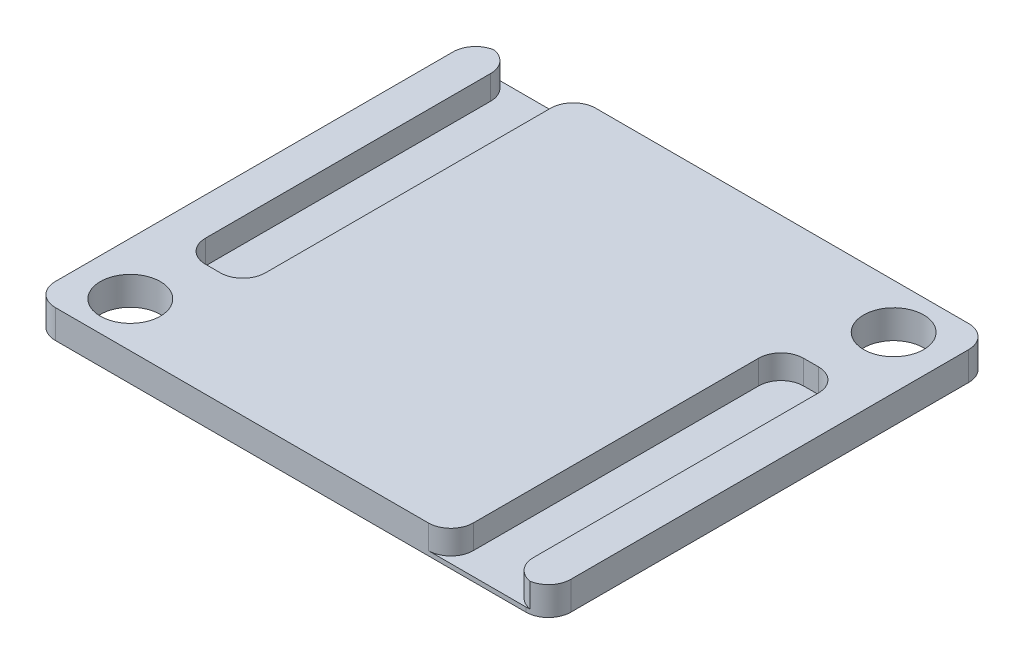
ISO-10303-21;
HEADER;
FILE_DESCRIPTION(('STEP AP214'),'2;1');
FILE_NAME('part.step','',(''),(''),'','','');
FILE_SCHEMA(('AUTOMOTIVE_DESIGN { 1 0 10303 214 1 1 1 1 }'));
ENDSEC;
DATA;
#1=APPLICATION_CONTEXT('core data for automotive mechanical design processes');
#2=APPLICATION_PROTOCOL_DEFINITION('international standard','automotive_design',2000,#1);
#3=PRODUCT_CONTEXT('',#1,'mechanical');
#4=PRODUCT('Part','Part','',(#3));
#5=PRODUCT_RELATED_PRODUCT_CATEGORY('part','',(#4));
#6=PRODUCT_DEFINITION_FORMATION('','',#4);
#7=PRODUCT_DEFINITION_CONTEXT('part definition',#1,'design');
#8=PRODUCT_DEFINITION('design','',#6,#7);
#9=PRODUCT_DEFINITION_SHAPE('','',#8);
#10=(LENGTH_UNIT() NAMED_UNIT(*) SI_UNIT(.MILLI.,.METRE.));
#11=(NAMED_UNIT(*) PLANE_ANGLE_UNIT() SI_UNIT($,.RADIAN.));
#12=(NAMED_UNIT(*) SI_UNIT($,.STERADIAN.) SOLID_ANGLE_UNIT());
#13=UNCERTAINTY_MEASURE_WITH_UNIT(LENGTH_MEASURE(1.E-05),#10,'distance_accuracy_value','');
#14=(GEOMETRIC_REPRESENTATION_CONTEXT(3) GLOBAL_UNCERTAINTY_ASSIGNED_CONTEXT((#13)) GLOBAL_UNIT_ASSIGNED_CONTEXT((#10,
#11,#12)) REPRESENTATION_CONTEXT('',''));
#15=CARTESIAN_POINT('',(0.,0.,0.));
#16=DIRECTION('',(0.,0.,1.));
#17=DIRECTION('',(1.,0.,0.));
#18=AXIS2_PLACEMENT_3D('',#15,#16,#17);
#19=CARTESIAN_POINT('',(0.,1.9,0.));
#20=DIRECTION('',(0.,1.,0.));
#21=DIRECTION('',(0.,0.,1.));
#22=AXIS2_PLACEMENT_3D('',#19,#20,#21);
#23=PLANE('',#22);
#24=DIRECTION('',(-1.,0.,0.));
#25=VECTOR('',#24,1.);
#26=CARTESIAN_POINT('',(0.,1.9,-29.5));
#27=LINE('',#26,#25);
#28=CARTESIAN_POINT('',(32.85,1.9,-29.5));
#29=VERTEX_POINT('',#28);
#30=CARTESIAN_POINT('',(8.,1.9,-29.5));
#31=VERTEX_POINT('',#30);
#32=EDGE_CURVE('E300',#29,#31,#27,.T.);
#33=ORIENTED_EDGE('',*,*,#32,.T.);
#34=CARTESIAN_POINT('',(8.,1.9,-28.));
#35=DIRECTION('',(0.,1.,0.));
#36=DIRECTION('',(0.,0.,1.));
#37=AXIS2_PLACEMENT_3D('',#34,#35,#36);
#38=CIRCLE('',#37,1.5);
#39=CARTESIAN_POINT('',(6.5,1.9,-28.));
#40=VERTEX_POINT('',#39);
#41=EDGE_CURVE('E338',#31,#40,#38,.T.);
#42=ORIENTED_EDGE('',*,*,#41,.T.);
#43=DIRECTION('',(0.,0.,-1.));
#44=VECTOR('',#43,1.);
#45=CARTESIAN_POINT('',(6.5,1.9,-29.5));
#46=LINE('',#45,#44);
#47=CARTESIAN_POINT('',(6.50000000000001,1.9,-9.));
#48=VERTEX_POINT('',#47);
#49=EDGE_CURVE('E242',#48,#40,#46,.T.);
#50=ORIENTED_EDGE('',*,*,#49,.F.);
#51=CARTESIAN_POINT('',(5.00000000000001,1.9,-9.));
#52=DIRECTION('',(0.,1.,0.));
#53=DIRECTION('',(0.,0.,1.));
#54=AXIS2_PLACEMENT_3D('',#51,#52,#53);
#55=CIRCLE('',#54,1.5);
#56=CARTESIAN_POINT('',(5.00000000000001,1.9,-7.5));
#57=VERTEX_POINT('',#56);
#58=EDGE_CURVE('E240',#48,#57,#55,.F.);
#59=ORIENTED_EDGE('',*,*,#58,.T.);
#60=DIRECTION('',(1.,0.,0.));
#61=VECTOR('',#60,1.);
#62=CARTESIAN_POINT('',(2.5,1.9,-7.5));
#63=LINE('',#62,#61);
#64=CARTESIAN_POINT('',(4.,1.9,-7.5));
#65=VERTEX_POINT('',#64);
#66=EDGE_CURVE('E229',#65,#57,#63,.T.);
#67=ORIENTED_EDGE('',*,*,#66,.F.);
#68=CARTESIAN_POINT('',(4.,1.9,-9.));
#69=DIRECTION('',(0.,1.,0.));
#70=DIRECTION('',(0.,0.,1.));
#71=AXIS2_PLACEMENT_3D('',#68,#69,#70);
#72=CIRCLE('',#71,1.5);
#73=CARTESIAN_POINT('',(2.5,1.9,-9.));
#74=VERTEX_POINT('',#73);
#75=EDGE_CURVE('E211',#65,#74,#72,.F.);
#76=ORIENTED_EDGE('',*,*,#75,.T.);
#77=DIRECTION('',(0.,0.,1.));
#78=VECTOR('',#77,1.);
#79=CARTESIAN_POINT('',(2.5,1.9,-29.5));
#80=LINE('',#79,#78);
#81=CARTESIAN_POINT('',(2.5,1.9,-28.));
#82=VERTEX_POINT('',#81);
#83=EDGE_CURVE('E243',#82,#74,#80,.T.);
#84=ORIENTED_EDGE('',*,*,#83,.F.);
#85=CARTESIAN_POINT('',(1.,1.9,-28.));
#86=DIRECTION('',(0.,1.,0.));
#87=DIRECTION('',(0.,0.,1.));
#88=AXIS2_PLACEMENT_3D('',#85,#86,#87);
#89=CIRCLE('',#88,1.5);
#90=CARTESIAN_POINT('',(1.25,1.9,-29.4790199457749));
#91=VERTEX_POINT('',#90);
#92=EDGE_CURVE('E336',#82,#91,#89,.T.);
#93=ORIENTED_EDGE('',*,*,#92,.T.);
#94=CARTESIAN_POINT('',(1.5,1.9,-28.));
#95=DIRECTION('',(0.,1.,0.));
#96=DIRECTION('',(0.,0.,1.));
#97=AXIS2_PLACEMENT_3D('',#94,#95,#96);
#98=CIRCLE('',#97,1.5);
#99=CARTESIAN_POINT('',(0.,1.9,-28.));
#100=VERTEX_POINT('',#99);
#101=EDGE_CURVE('E334',#91,#100,#98,.T.);
#102=ORIENTED_EDGE('',*,*,#101,.T.);
#103=DIRECTION('',(0.,0.,1.));
#104=VECTOR('',#103,1.);
#105=CARTESIAN_POINT('',(0.,1.9,-29.5));
#106=LINE('',#105,#104);
#107=CARTESIAN_POINT('',(0.,1.9,-1.50000000000001));
#108=VERTEX_POINT('',#107);
#109=EDGE_CURVE('E289',#100,#108,#106,.T.);
#110=ORIENTED_EDGE('',*,*,#109,.T.);
#111=CARTESIAN_POINT('',(1.5,1.9,-1.5));
#112=DIRECTION('',(0.,1.,0.));
#113=DIRECTION('',(0.,0.,1.));
#114=AXIS2_PLACEMENT_3D('',#111,#112,#113);
#115=CIRCLE('',#114,1.5);
#116=CARTESIAN_POINT('',(1.5,1.9,0.));
#117=VERTEX_POINT('',#116);
#118=EDGE_CURVE('E332',#108,#117,#115,.T.);
#119=ORIENTED_EDGE('',*,*,#118,.T.);
#120=DIRECTION('',(1.,0.,0.));
#121=VECTOR('',#120,1.);
#122=CARTESIAN_POINT('',(0.,1.9,0.));
#123=LINE('',#122,#121);
#124=CARTESIAN_POINT('',(26.35,1.9,0.));
#125=VERTEX_POINT('',#124);
#126=EDGE_CURVE('E293',#117,#125,#123,.T.);
#127=ORIENTED_EDGE('',*,*,#126,.T.);
#128=CARTESIAN_POINT('',(26.35,1.9,-1.5));
#129=DIRECTION('',(0.,1.,0.));
#130=DIRECTION('',(0.,0.,1.));
#131=AXIS2_PLACEMENT_3D('',#128,#129,#130);
#132=CIRCLE('',#131,1.5);
#133=CARTESIAN_POINT('',(27.85,1.9,-1.5));
#134=VERTEX_POINT('',#133);
#135=EDGE_CURVE('E324',#125,#134,#132,.T.);
#136=ORIENTED_EDGE('',*,*,#135,.T.);
#137=DIRECTION('',(0.,0.,1.));
#138=VECTOR('',#137,1.);
#139=CARTESIAN_POINT('',(27.85,1.9,-22.));
#140=LINE('',#139,#138);
#141=CARTESIAN_POINT('',(27.85,1.9,-20.5));
#142=VERTEX_POINT('',#141);
#143=EDGE_CURVE('E268',#142,#134,#140,.T.);
#144=ORIENTED_EDGE('',*,*,#143,.F.);
#145=CARTESIAN_POINT('',(29.35,1.9,-20.5));
#146=DIRECTION('',(0.,1.,0.));
#147=DIRECTION('',(0.,0.,1.));
#148=AXIS2_PLACEMENT_3D('',#145,#146,#147);
#149=CIRCLE('',#148,1.5);
#150=CARTESIAN_POINT('',(29.35,1.9,-22.));
#151=VERTEX_POINT('',#150);
#152=EDGE_CURVE('E11',#142,#151,#149,.F.);
#153=ORIENTED_EDGE('',*,*,#152,.T.);
#154=DIRECTION('',(-1.,0.,0.));
#155=VECTOR('',#154,1.);
#156=CARTESIAN_POINT('',(27.85,1.9,-22.));
#157=LINE('',#156,#155);
#158=CARTESIAN_POINT('',(30.35,1.9,-22.));
#159=VERTEX_POINT('',#158);
#160=EDGE_CURVE('E259',#159,#151,#157,.T.);
#161=ORIENTED_EDGE('',*,*,#160,.F.);
#162=CARTESIAN_POINT('',(30.35,1.9,-20.5));
#163=DIRECTION('',(0.,1.,0.));
#164=DIRECTION('',(0.,0.,1.));
#165=AXIS2_PLACEMENT_3D('',#162,#163,#164);
#166=CIRCLE('',#165,1.5);
#167=CARTESIAN_POINT('',(31.85,1.9,-20.5));
#168=VERTEX_POINT('',#167);
#169=EDGE_CURVE('E406',#159,#168,#166,.F.);
#170=ORIENTED_EDGE('',*,*,#169,.T.);
#171=DIRECTION('',(0.,0.,-1.));
#172=VECTOR('',#171,1.);
#173=CARTESIAN_POINT('',(31.85,1.9,-22.));
#174=LINE('',#173,#172);
#175=CARTESIAN_POINT('',(31.85,1.9,-1.5));
#176=VERTEX_POINT('',#175);
#177=EDGE_CURVE('E271',#176,#168,#174,.T.);
#178=ORIENTED_EDGE('',*,*,#177,.F.);
#179=CARTESIAN_POINT('',(33.35,1.9,-1.5));
#180=DIRECTION('',(0.,1.,0.));
#181=DIRECTION('',(0.,0.,1.));
#182=AXIS2_PLACEMENT_3D('',#179,#180,#181);
#183=CIRCLE('',#182,1.5);
#184=CARTESIAN_POINT('',(33.1,1.9,-0.0209800542250972));
#185=VERTEX_POINT('',#184);
#186=EDGE_CURVE('E326',#176,#185,#183,.T.);
#187=ORIENTED_EDGE('',*,*,#186,.T.);
#188=CARTESIAN_POINT('',(32.85,1.9,-1.5));
#189=DIRECTION('',(0.,1.,0.));
#190=DIRECTION('',(0.,0.,1.));
#191=AXIS2_PLACEMENT_3D('',#188,#189,#190);
#192=CIRCLE('',#191,1.5);
#193=CARTESIAN_POINT('',(34.35,1.9,-1.5));
#194=VERTEX_POINT('',#193);
#195=EDGE_CURVE('E328',#185,#194,#192,.T.);
#196=ORIENTED_EDGE('',*,*,#195,.T.);
#197=DIRECTION('',(0.,0.,-1.));
#198=VECTOR('',#197,1.);
#199=CARTESIAN_POINT('',(34.35,1.9,0.));
#200=LINE('',#199,#198);
#201=CARTESIAN_POINT('',(34.35,1.9,-28.));
#202=VERTEX_POINT('',#201);
#203=EDGE_CURVE('E297',#194,#202,#200,.T.);
#204=ORIENTED_EDGE('',*,*,#203,.T.);
#205=CARTESIAN_POINT('',(32.85,1.9,-28.));
#206=DIRECTION('',(0.,1.,0.));
#207=DIRECTION('',(0.,0.,1.));
#208=AXIS2_PLACEMENT_3D('',#205,#206,#207);
#209=CIRCLE('',#208,1.5);
#210=EDGE_CURVE('E330',#202,#29,#209,.T.);
#211=ORIENTED_EDGE('',*,*,#210,.T.);
#212=EDGE_LOOP('',(#33,#42,#50,#59,#67,#76,#84,#93,#102,#110,#119,#127,#136,#144,#153,#161,#170,
#178,#187,#196,#204,#211));
#213=FACE_BOUND('',#212,.T.);
#214=CARTESIAN_POINT('',(3.5,1.9,-3.));
#215=DIRECTION('',(0.,1.,0.));
#216=DIRECTION('',(0.,0.,1.));
#217=AXIS2_PLACEMENT_3D('',#214,#215,#216);
#218=CIRCLE('',#217,2.);
#219=CARTESIAN_POINT('',(3.5,1.9,-5.));
#220=VERTEX_POINT('',#219);
#221=EDGE_CURVE('E283',#220,#220,#218,.T.);
#222=ORIENTED_EDGE('',*,*,#221,.F.);
#223=EDGE_LOOP('',(#222));
#224=FACE_BOUND('',#223,.T.);
#225=CARTESIAN_POINT('',(30.85,1.9,-26.5));
#226=DIRECTION('',(0.,1.,0.));
#227=DIRECTION('',(0.,0.,1.));
#228=AXIS2_PLACEMENT_3D('',#225,#226,#227);
#229=CIRCLE('',#228,2.);
#230=CARTESIAN_POINT('',(30.85,1.9,-28.5));
#231=VERTEX_POINT('',#230);
#232=EDGE_CURVE('E277',#231,#231,#229,.T.);
#233=ORIENTED_EDGE('',*,*,#232,.F.);
#234=EDGE_LOOP('',(#233));
#235=FACE_BOUND('',#234,.T.);
#236=ADVANCED_FACE('F42',(#213,#224,#235),#23,.T.);
#237=CARTESIAN_POINT('',(0.,0.,0.));
#238=DIRECTION('',(0.,1.,0.));
#239=DIRECTION('',(0.,0.,1.));
#240=AXIS2_PLACEMENT_3D('',#237,#238,#239);
#241=PLANE('',#240);
#242=CARTESIAN_POINT('',(3.5,0.,-3.));
#243=DIRECTION('',(0.,1.,0.));
#244=DIRECTION('',(0.,0.,1.));
#245=AXIS2_PLACEMENT_3D('',#242,#243,#244);
#246=CIRCLE('',#245,2.);
#247=CARTESIAN_POINT('',(3.5,0.,-5.));
#248=VERTEX_POINT('',#247);
#249=EDGE_CURVE('E280',#248,#248,#246,.T.);
#250=ORIENTED_EDGE('',*,*,#249,.T.);
#251=EDGE_LOOP('',(#250));
#252=FACE_BOUND('',#251,.T.);
#253=DIRECTION('',(0.,0.,1.));
#254=VECTOR('',#253,1.);
#255=CARTESIAN_POINT('',(0.,0.,-29.5));
#256=LINE('',#255,#254);
#257=CARTESIAN_POINT('',(0.,0.,-28.));
#258=VERTEX_POINT('',#257);
#259=CARTESIAN_POINT('',(0.,0.,-1.50000000000001));
#260=VERTEX_POINT('',#259);
#261=EDGE_CURVE('E286',#258,#260,#256,.T.);
#262=ORIENTED_EDGE('',*,*,#261,.F.);
#263=CARTESIAN_POINT('',(1.5,0.,-28.));
#264=DIRECTION('',(0.,1.,0.));
#265=DIRECTION('',(0.,0.,1.));
#266=AXIS2_PLACEMENT_3D('',#263,#264,#265);
#267=CIRCLE('',#266,1.5);
#268=CARTESIAN_POINT('',(1.5,0.,-29.5));
#269=VERTEX_POINT('',#268);
#270=EDGE_CURVE('E365',#258,#269,#267,.F.);
#271=ORIENTED_EDGE('',*,*,#270,.T.);
#272=DIRECTION('',(-1.,0.,0.));
#273=VECTOR('',#272,1.);
#274=CARTESIAN_POINT('',(0.,0.,-29.5));
#275=LINE('',#274,#273);
#276=CARTESIAN_POINT('',(32.85,0.,-29.5));
#277=VERTEX_POINT('',#276);
#278=EDGE_CURVE('E294',#277,#269,#275,.T.);
#279=ORIENTED_EDGE('',*,*,#278,.F.);
#280=CARTESIAN_POINT('',(32.85,0.,-28.));
#281=DIRECTION('',(0.,1.,0.));
#282=DIRECTION('',(0.,0.,1.));
#283=AXIS2_PLACEMENT_3D('',#280,#281,#282);
#284=CIRCLE('',#283,1.5);
#285=CARTESIAN_POINT('',(34.35,0.,-28.));
#286=VERTEX_POINT('',#285);
#287=EDGE_CURVE('E361',#277,#286,#284,.F.);
#288=ORIENTED_EDGE('',*,*,#287,.T.);
#289=DIRECTION('',(0.,0.,-1.));
#290=VECTOR('',#289,1.);
#291=CARTESIAN_POINT('',(34.35,0.,0.));
#292=LINE('',#291,#290);
#293=CARTESIAN_POINT('',(34.35,0.,-1.5));
#294=VERTEX_POINT('',#293);
#295=EDGE_CURVE('E308',#294,#286,#292,.T.);
#296=ORIENTED_EDGE('',*,*,#295,.F.);
#297=CARTESIAN_POINT('',(32.85,0.,-1.5));
#298=DIRECTION('',(0.,1.,0.));
#299=DIRECTION('',(0.,0.,1.));
#300=AXIS2_PLACEMENT_3D('',#297,#298,#299);
#301=CIRCLE('',#300,1.5);
#302=CARTESIAN_POINT('',(32.85,0.,0.));
#303=VERTEX_POINT('',#302);
#304=EDGE_CURVE('E359',#294,#303,#301,.F.);
#305=ORIENTED_EDGE('',*,*,#304,.T.);
#306=DIRECTION('',(1.,0.,0.));
#307=VECTOR('',#306,1.);
#308=CARTESIAN_POINT('',(0.,0.,0.));
#309=LINE('',#308,#307);
#310=CARTESIAN_POINT('',(1.5,0.,0.));
#311=VERTEX_POINT('',#310);
#312=EDGE_CURVE('E305',#311,#303,#309,.T.);
#313=ORIENTED_EDGE('',*,*,#312,.F.);
#314=CARTESIAN_POINT('',(1.5,0.,-1.5));
#315=DIRECTION('',(0.,1.,0.));
#316=DIRECTION('',(0.,0.,1.));
#317=AXIS2_PLACEMENT_3D('',#314,#315,#316);
#318=CIRCLE('',#317,1.5);
#319=EDGE_CURVE('E363',#311,#260,#318,.F.);
#320=ORIENTED_EDGE('',*,*,#319,.T.);
#321=EDGE_LOOP('',(#262,#271,#279,#288,#296,#305,#313,#320));
#322=FACE_BOUND('',#321,.T.);
#323=CARTESIAN_POINT('',(30.85,0.,-26.5));
#324=DIRECTION('',(0.,1.,0.));
#325=DIRECTION('',(0.,0.,1.));
#326=AXIS2_PLACEMENT_3D('',#323,#324,#325);
#327=CIRCLE('',#326,2.);
#328=CARTESIAN_POINT('',(30.85,0.,-28.5));
#329=VERTEX_POINT('',#328);
#330=EDGE_CURVE('E267',#329,#329,#327,.T.);
#331=ORIENTED_EDGE('',*,*,#330,.T.);
#332=EDGE_LOOP('',(#331));
#333=FACE_BOUND('',#332,.T.);
#334=ADVANCED_FACE('F463',(#252,#322,#333),#241,.F.);
#335=CARTESIAN_POINT('',(0.,1.9,-29.5));
#336=DIRECTION('',(1.,0.,0.));
#337=DIRECTION('',(0.,0.,-1.));
#338=AXIS2_PLACEMENT_3D('',#335,#336,#337);
#339=PLANE('',#338);
#340=ORIENTED_EDGE('',*,*,#109,.F.);
#341=DIRECTION('',(0.,-1.,0.));
#342=VECTOR('',#341,1.);
#343=CARTESIAN_POINT('',(0.,1.9,-28.));
#344=LINE('',#343,#342);
#345=EDGE_CURVE('E357',#100,#258,#344,.T.);
#346=ORIENTED_EDGE('',*,*,#345,.T.);
#347=ORIENTED_EDGE('',*,*,#261,.T.);
#348=DIRECTION('',(0.,-1.,0.));
#349=VECTOR('',#348,1.);
#350=CARTESIAN_POINT('',(0.,1.9,-1.5));
#351=LINE('',#350,#349);
#352=EDGE_CURVE('E355',#260,#108,#351,.F.);
#353=ORIENTED_EDGE('',*,*,#352,.T.);
#354=EDGE_LOOP('',(#340,#346,#347,#353));
#355=FACE_BOUND('',#354,.T.);
#356=ADVANCED_FACE('F483',(#355),#339,.F.);
#357=CARTESIAN_POINT('',(0.,1.9,0.));
#358=DIRECTION('',(0.,0.,-1.));
#359=DIRECTION('',(-1.,0.,0.));
#360=AXIS2_PLACEMENT_3D('',#357,#358,#359);
#361=PLANE('',#360);
#362=ORIENTED_EDGE('',*,*,#126,.F.);
#363=DIRECTION('',(0.,-1.,0.));
#364=VECTOR('',#363,1.);
#365=CARTESIAN_POINT('',(1.5,1.9,0.));
#366=LINE('',#365,#364);
#367=EDGE_CURVE('E373',#117,#311,#366,.T.);
#368=ORIENTED_EDGE('',*,*,#367,.T.);
#369=ORIENTED_EDGE('',*,*,#312,.T.);
#370=DIRECTION('',(0.,-1.,0.));
#371=VECTOR('',#370,1.);
#372=CARTESIAN_POINT('',(32.85,1.9,0.));
#373=LINE('',#372,#371);
#374=CARTESIAN_POINT('',(32.85,0.3,0.));
#375=VERTEX_POINT('',#374);
#376=EDGE_CURVE('E370',#303,#375,#373,.F.);
#377=ORIENTED_EDGE('',*,*,#376,.T.);
#378=DIRECTION('',(1.,0.,0.));
#379=VECTOR('',#378,1.);
#380=CARTESIAN_POINT('',(27.85,0.3,0.));
#381=LINE('',#380,#379);
#382=CARTESIAN_POINT('',(26.35,0.3,0.));
#383=VERTEX_POINT('',#382);
#384=EDGE_CURVE('E258',#383,#375,#381,.T.);
#385=ORIENTED_EDGE('',*,*,#384,.F.);
#386=DIRECTION('',(0.,1.,0.));
#387=VECTOR('',#386,1.);
#388=CARTESIAN_POINT('',(26.35,1.9,0.));
#389=LINE('',#388,#387);
#390=EDGE_CURVE('E367',#383,#125,#389,.T.);
#391=ORIENTED_EDGE('',*,*,#390,.T.);
#392=EDGE_LOOP('',(#362,#368,#369,#377,#385,#391));
#393=FACE_BOUND('',#392,.T.);
#394=ADVANCED_FACE('F454',(#393),#361,.F.);
#395=CARTESIAN_POINT('',(34.35,1.9,0.));
#396=DIRECTION('',(-1.,0.,0.));
#397=DIRECTION('',(0.,0.,1.));
#398=AXIS2_PLACEMENT_3D('',#395,#396,#397);
#399=PLANE('',#398);
#400=ORIENTED_EDGE('',*,*,#295,.T.);
#401=DIRECTION('',(0.,-1.,0.));
#402=VECTOR('',#401,1.);
#403=CARTESIAN_POINT('',(34.35,1.9,-28.));
#404=LINE('',#403,#402);
#405=EDGE_CURVE('E379',#286,#202,#404,.F.);
#406=ORIENTED_EDGE('',*,*,#405,.T.);
#407=ORIENTED_EDGE('',*,*,#203,.F.);
#408=DIRECTION('',(0.,-1.,0.));
#409=VECTOR('',#408,1.);
#410=CARTESIAN_POINT('',(34.35,1.9,-1.5));
#411=LINE('',#410,#409);
#412=EDGE_CURVE('E376',#194,#294,#411,.T.);
#413=ORIENTED_EDGE('',*,*,#412,.T.);
#414=EDGE_LOOP('',(#400,#406,#407,#413));
#415=FACE_BOUND('',#414,.T.);
#416=ADVANCED_FACE('F460',(#415),#399,.F.);
#417=CARTESIAN_POINT('',(0.,1.9,-29.5));
#418=DIRECTION('',(0.,0.,1.));
#419=DIRECTION('',(1.,0.,0.));
#420=AXIS2_PLACEMENT_3D('',#417,#418,#419);
#421=PLANE('',#420);
#422=DIRECTION('',(-1.,0.,0.));
#423=VECTOR('',#422,1.);
#424=CARTESIAN_POINT('',(2.5,0.3,-29.5));
#425=LINE('',#424,#423);
#426=CARTESIAN_POINT('',(8.,0.3,-29.5));
#427=VERTEX_POINT('',#426);
#428=CARTESIAN_POINT('',(1.5,0.3,-29.5));
#429=VERTEX_POINT('',#428);
#430=EDGE_CURVE('E272',#427,#429,#425,.T.);
#431=ORIENTED_EDGE('',*,*,#430,.F.);
#432=DIRECTION('',(0.,1.,0.));
#433=VECTOR('',#432,1.);
#434=CARTESIAN_POINT('',(8.,1.9,-29.5));
#435=LINE('',#434,#433);
#436=EDGE_CURVE('E346',#427,#31,#435,.T.);
#437=ORIENTED_EDGE('',*,*,#436,.T.);
#438=ORIENTED_EDGE('',*,*,#32,.F.);
#439=DIRECTION('',(0.,-1.,0.));
#440=VECTOR('',#439,1.);
#441=CARTESIAN_POINT('',(32.85,1.9,-29.5));
#442=LINE('',#441,#440);
#443=EDGE_CURVE('E340',#29,#277,#442,.T.);
#444=ORIENTED_EDGE('',*,*,#443,.T.);
#445=ORIENTED_EDGE('',*,*,#278,.T.);
#446=DIRECTION('',(0.,-1.,0.));
#447=VECTOR('',#446,1.);
#448=CARTESIAN_POINT('',(1.5,1.9,-29.5));
#449=LINE('',#448,#447);
#450=EDGE_CURVE('E343',#269,#429,#449,.F.);
#451=ORIENTED_EDGE('',*,*,#450,.T.);
#452=EDGE_LOOP('',(#431,#437,#438,#444,#445,#451));
#453=FACE_BOUND('',#452,.T.);
#454=ADVANCED_FACE('F472',(#453),#421,.F.);
#455=CARTESIAN_POINT('',(3.5,1.9,-3.));
#456=DIRECTION('',(0.,-1.,0.));
#457=DIRECTION('',(0.,0.,-1.));
#458=AXIS2_PLACEMENT_3D('',#455,#456,#457);
#459=CYLINDRICAL_SURFACE('',#458,2.);
#460=CARTESIAN_POINT('',(3.5,1.9,-5.));
#461=CARTESIAN_POINT('',(3.5,1.88020833333333,-5.));
#462=CARTESIAN_POINT('',(3.5,1.86041666666667,-5.));
#463=CARTESIAN_POINT('',(3.5,1.82083333333333,-5.));
#464=CARTESIAN_POINT('',(3.5,1.80104166666667,-5.));
#465=CARTESIAN_POINT('',(3.5,1.76145833333333,-5.));
#466=CARTESIAN_POINT('',(3.5,1.74166666666667,-5.));
#467=CARTESIAN_POINT('',(3.5,1.70208333333333,-5.));
#468=CARTESIAN_POINT('',(3.5,1.68229166666667,-5.));
#469=CARTESIAN_POINT('',(3.5,1.64270833333333,-5.));
#470=CARTESIAN_POINT('',(3.5,1.62291666666667,-5.));
#471=CARTESIAN_POINT('',(3.5,1.58333333333333,-5.));
#472=CARTESIAN_POINT('',(3.5,1.56354166666667,-5.));
#473=CARTESIAN_POINT('',(3.5,1.52395833333333,-5.));
#474=CARTESIAN_POINT('',(3.5,1.50416666666667,-5.));
#475=CARTESIAN_POINT('',(3.5,1.46458333333333,-5.));
#476=CARTESIAN_POINT('',(3.5,1.44479166666667,-5.));
#477=CARTESIAN_POINT('',(3.5,1.40520833333333,-5.));
#478=CARTESIAN_POINT('',(3.5,1.38541666666667,-5.));
#479=CARTESIAN_POINT('',(3.5,1.34583333333333,-5.));
#480=CARTESIAN_POINT('',(3.5,1.32604166666667,-5.));
#481=CARTESIAN_POINT('',(3.5,1.28645833333333,-5.));
#482=CARTESIAN_POINT('',(3.5,1.26666666666667,-5.));
#483=CARTESIAN_POINT('',(3.5,1.22708333333333,-5.));
#484=CARTESIAN_POINT('',(3.5,1.20729166666667,-5.));
#485=CARTESIAN_POINT('',(3.5,1.16770833333333,-5.));
#486=CARTESIAN_POINT('',(3.5,1.14791666666667,-5.));
#487=CARTESIAN_POINT('',(3.5,1.10833333333333,-5.));
#488=CARTESIAN_POINT('',(3.5,1.08854166666667,-5.));
#489=CARTESIAN_POINT('',(3.5,1.04895833333333,-5.));
#490=CARTESIAN_POINT('',(3.5,1.02916666666667,-5.));
#491=CARTESIAN_POINT('',(3.5,0.989583333333333,-5.));
#492=CARTESIAN_POINT('',(3.5,0.969791666666666,-5.));
#493=CARTESIAN_POINT('',(3.5,0.930208333333333,-5.));
#494=CARTESIAN_POINT('',(3.5,0.910416666666667,-5.));
#495=CARTESIAN_POINT('',(3.5,0.870833333333333,-5.));
#496=CARTESIAN_POINT('',(3.5,0.851041666666667,-5.));
#497=CARTESIAN_POINT('',(3.5,0.811458333333333,-5.));
#498=CARTESIAN_POINT('',(3.5,0.791666666666667,-5.));
#499=CARTESIAN_POINT('',(3.5,0.752083333333333,-5.));
#500=CARTESIAN_POINT('',(3.5,0.732291666666667,-5.));
#501=CARTESIAN_POINT('',(3.5,0.692708333333333,-5.));
#502=CARTESIAN_POINT('',(3.5,0.672916666666667,-5.));
#503=CARTESIAN_POINT('',(3.5,0.633333333333333,-5.));
#504=CARTESIAN_POINT('',(3.5,0.613541666666667,-5.));
#505=CARTESIAN_POINT('',(3.5,0.573958333333333,-5.));
#506=CARTESIAN_POINT('',(3.5,0.554166666666667,-5.));
#507=CARTESIAN_POINT('',(3.5,0.514583333333334,-5.));
#508=CARTESIAN_POINT('',(3.5,0.494791666666667,-5.));
#509=CARTESIAN_POINT('',(3.5,0.455208333333333,-5.));
#510=CARTESIAN_POINT('',(3.5,0.435416666666667,-5.));
#511=CARTESIAN_POINT('',(3.5,0.395833333333333,-5.));
#512=CARTESIAN_POINT('',(3.5,0.376041666666667,-5.));
#513=CARTESIAN_POINT('',(3.5,0.336458333333333,-5.));
#514=CARTESIAN_POINT('',(3.5,0.316666666666667,-5.));
#515=CARTESIAN_POINT('',(3.5,0.277083333333333,-5.));
#516=CARTESIAN_POINT('',(3.5,0.257291666666667,-5.));
#517=CARTESIAN_POINT('',(3.5,0.217708333333333,-5.));
#518=CARTESIAN_POINT('',(3.5,0.197916666666667,-5.));
#519=CARTESIAN_POINT('',(3.5,0.158333333333333,-5.));
#520=CARTESIAN_POINT('',(3.5,0.138541666666667,-5.));
#521=CARTESIAN_POINT('',(3.5,0.0989583333333333,-5.));
#522=CARTESIAN_POINT('',(3.5,0.0791666666666666,-5.));
#523=CARTESIAN_POINT('',(3.5,0.0395833333333333,-5.));
#524=CARTESIAN_POINT('',(3.5,0.0197916666666666,-5.));
#525=CARTESIAN_POINT('',(3.5,0.,-5.));
#526=B_SPLINE_CURVE_WITH_KNOTS('',3,(#460,#461,#462,#463,#464,#465,#466,#467,#468,#469,#470,
#471,#472,#473,#474,#475,#476,#477,#478,#479,#480,#481,#482,#483,#484,#485,#486,#487,#488,#489,
#490,#491,#492,#493,#494,#495,#496,#497,#498,#499,#500,#501,#502,#503,#504,#505,#506,#507,#508,
#509,#510,#511,#512,#513,#514,#515,#516,#517,#518,#519,#520,#521,#522,#523,#524,#525),
.UNSPECIFIED.,.F.,.F.,(4,2,2,2,2,2,2,2,2,2,2,2,2,2,2,2,2,2,2,2,2,2,2,2,2,2,2,2,2,2,2,2,4),(0.,
0.0593750000000002,0.11875,0.178125,0.2375,0.296875,0.35625,0.415625,0.475,0.534375,0.59375,
0.653125,0.7125,0.771875,0.83125,0.890625,0.95,1.009375,1.06875,1.128125,1.1875,1.246875,
1.30625,1.365625,1.425,1.484375,1.54375,1.603125,1.6625,1.721875,1.78125,1.840625,1.9),.UNSPECIFIED.);
#527=EDGE_CURVE('BSEAM531',#220,#248,#526,.T.);
#528=ORIENTED_EDGE('',*,*,#221,.T.);
#529=ORIENTED_EDGE('',*,*,#249,.F.);
#530=ORIENTED_EDGE('',*,*,#527,.T.);
#531=ORIENTED_EDGE('',*,*,#527,.F.);
#532=EDGE_LOOP('',(#528,#530,#529,#531));
#533=FACE_BOUND('',#532,.T.);
#534=ADVANCED_FACE('F531',(#533),#459,.F.);
#535=CARTESIAN_POINT('',(30.85,1.9,-26.5));
#536=DIRECTION('',(0.,-1.,0.));
#537=DIRECTION('',(0.,0.,-1.));
#538=AXIS2_PLACEMENT_3D('',#535,#536,#537);
#539=CYLINDRICAL_SURFACE('',#538,2.);
#540=CARTESIAN_POINT('',(30.85,1.9,-28.5));
#541=CARTESIAN_POINT('',(30.85,1.88020833333333,-28.5));
#542=CARTESIAN_POINT('',(30.85,1.86041666666667,-28.5));
#543=CARTESIAN_POINT('',(30.85,1.82083333333333,-28.5));
#544=CARTESIAN_POINT('',(30.85,1.80104166666667,-28.5));
#545=CARTESIAN_POINT('',(30.85,1.76145833333333,-28.5));
#546=CARTESIAN_POINT('',(30.85,1.74166666666667,-28.5));
#547=CARTESIAN_POINT('',(30.85,1.70208333333333,-28.5));
#548=CARTESIAN_POINT('',(30.85,1.68229166666667,-28.5));
#549=CARTESIAN_POINT('',(30.85,1.64270833333333,-28.5));
#550=CARTESIAN_POINT('',(30.85,1.62291666666667,-28.5));
#551=CARTESIAN_POINT('',(30.85,1.58333333333333,-28.5));
#552=CARTESIAN_POINT('',(30.85,1.56354166666667,-28.5));
#553=CARTESIAN_POINT('',(30.85,1.52395833333333,-28.5));
#554=CARTESIAN_POINT('',(30.85,1.50416666666667,-28.5));
#555=CARTESIAN_POINT('',(30.85,1.46458333333333,-28.5));
#556=CARTESIAN_POINT('',(30.85,1.44479166666667,-28.5));
#557=CARTESIAN_POINT('',(30.85,1.40520833333333,-28.5));
#558=CARTESIAN_POINT('',(30.85,1.38541666666667,-28.5));
#559=CARTESIAN_POINT('',(30.85,1.34583333333333,-28.5));
#560=CARTESIAN_POINT('',(30.85,1.32604166666667,-28.5));
#561=CARTESIAN_POINT('',(30.85,1.28645833333333,-28.5));
#562=CARTESIAN_POINT('',(30.85,1.26666666666667,-28.5));
#563=CARTESIAN_POINT('',(30.85,1.22708333333333,-28.5));
#564=CARTESIAN_POINT('',(30.85,1.20729166666667,-28.5));
#565=CARTESIAN_POINT('',(30.85,1.16770833333333,-28.5));
#566=CARTESIAN_POINT('',(30.85,1.14791666666667,-28.5));
#567=CARTESIAN_POINT('',(30.85,1.10833333333333,-28.5));
#568=CARTESIAN_POINT('',(30.85,1.08854166666667,-28.5));
#569=CARTESIAN_POINT('',(30.85,1.04895833333333,-28.5));
#570=CARTESIAN_POINT('',(30.85,1.02916666666667,-28.5));
#571=CARTESIAN_POINT('',(30.85,0.989583333333333,-28.5));
#572=CARTESIAN_POINT('',(30.85,0.969791666666666,-28.5));
#573=CARTESIAN_POINT('',(30.85,0.930208333333333,-28.5));
#574=CARTESIAN_POINT('',(30.85,0.910416666666667,-28.5));
#575=CARTESIAN_POINT('',(30.85,0.870833333333333,-28.5));
#576=CARTESIAN_POINT('',(30.85,0.851041666666667,-28.5));
#577=CARTESIAN_POINT('',(30.85,0.811458333333333,-28.5));
#578=CARTESIAN_POINT('',(30.85,0.791666666666667,-28.5));
#579=CARTESIAN_POINT('',(30.85,0.752083333333333,-28.5));
#580=CARTESIAN_POINT('',(30.85,0.732291666666667,-28.5));
#581=CARTESIAN_POINT('',(30.85,0.692708333333333,-28.5));
#582=CARTESIAN_POINT('',(30.85,0.672916666666667,-28.5));
#583=CARTESIAN_POINT('',(30.85,0.633333333333333,-28.5));
#584=CARTESIAN_POINT('',(30.85,0.613541666666667,-28.5));
#585=CARTESIAN_POINT('',(30.85,0.573958333333333,-28.5));
#586=CARTESIAN_POINT('',(30.85,0.554166666666667,-28.5));
#587=CARTESIAN_POINT('',(30.85,0.514583333333334,-28.5));
#588=CARTESIAN_POINT('',(30.85,0.494791666666667,-28.5));
#589=CARTESIAN_POINT('',(30.85,0.455208333333333,-28.5));
#590=CARTESIAN_POINT('',(30.85,0.435416666666667,-28.5));
#591=CARTESIAN_POINT('',(30.85,0.395833333333333,-28.5));
#592=CARTESIAN_POINT('',(30.85,0.376041666666667,-28.5));
#593=CARTESIAN_POINT('',(30.85,0.336458333333333,-28.5));
#594=CARTESIAN_POINT('',(30.85,0.316666666666667,-28.5));
#595=CARTESIAN_POINT('',(30.85,0.277083333333333,-28.5));
#596=CARTESIAN_POINT('',(30.85,0.257291666666667,-28.5));
#597=CARTESIAN_POINT('',(30.85,0.217708333333333,-28.5));
#598=CARTESIAN_POINT('',(30.85,0.197916666666667,-28.5));
#599=CARTESIAN_POINT('',(30.85,0.158333333333333,-28.5));
#600=CARTESIAN_POINT('',(30.85,0.138541666666667,-28.5));
#601=CARTESIAN_POINT('',(30.85,0.0989583333333333,-28.5));
#602=CARTESIAN_POINT('',(30.85,0.0791666666666666,-28.5));
#603=CARTESIAN_POINT('',(30.85,0.0395833333333333,-28.5));
#604=CARTESIAN_POINT('',(30.85,0.0197916666666666,-28.5));
#605=CARTESIAN_POINT('',(30.85,0.,-28.5));
#606=B_SPLINE_CURVE_WITH_KNOTS('',3,(#540,#541,#542,#543,#544,#545,#546,#547,#548,#549,#550,
#551,#552,#553,#554,#555,#556,#557,#558,#559,#560,#561,#562,#563,#564,#565,#566,#567,#568,#569,
#570,#571,#572,#573,#574,#575,#576,#577,#578,#579,#580,#581,#582,#583,#584,#585,#586,#587,#588,
#589,#590,#591,#592,#593,#594,#595,#596,#597,#598,#599,#600,#601,#602,#603,#604,#605),
.UNSPECIFIED.,.F.,.F.,(4,2,2,2,2,2,2,2,2,2,2,2,2,2,2,2,2,2,2,2,2,2,2,2,2,2,2,2,2,2,2,2,4),(0.,
0.0593750000000002,0.11875,0.178125,0.2375,0.296875,0.35625,0.415625,0.475,0.534375,0.59375,
0.653125,0.7125,0.771875,0.83125,0.890625,0.95,1.009375,1.06875,1.128125,1.1875,1.246875,
1.30625,1.365625,1.425,1.484375,1.54375,1.603125,1.6625,1.721875,1.78125,1.840625,1.9),.UNSPECIFIED.);
#607=EDGE_CURVE('BSEAM562',#231,#329,#606,.T.);
#608=ORIENTED_EDGE('',*,*,#232,.T.);
#609=ORIENTED_EDGE('',*,*,#330,.F.);
#610=ORIENTED_EDGE('',*,*,#607,.T.);
#611=ORIENTED_EDGE('',*,*,#607,.F.);
#612=EDGE_LOOP('',(#608,#610,#609,#611));
#613=FACE_BOUND('',#612,.T.);
#614=ADVANCED_FACE('F562',(#613),#539,.F.);
#615=CARTESIAN_POINT('',(27.85,0.3,-22.));
#616=DIRECTION('',(-1.,0.,0.));
#617=DIRECTION('',(0.,0.,1.));
#618=AXIS2_PLACEMENT_3D('',#615,#616,#617);
#619=PLANE('',#618);
#620=ORIENTED_EDGE('',*,*,#143,.T.);
#621=DIRECTION('',(0.,1.,0.));
#622=VECTOR('',#621,1.);
#623=CARTESIAN_POINT('',(27.85,0.3,-1.5));
#624=LINE('',#623,#622);
#625=CARTESIAN_POINT('',(27.85,0.3,-1.5));
#626=VERTEX_POINT('',#625);
#627=EDGE_CURVE('E223',#134,#626,#624,.F.);
#628=ORIENTED_EDGE('',*,*,#627,.T.);
#629=DIRECTION('',(0.,0.,1.));
#630=VECTOR('',#629,1.);
#631=CARTESIAN_POINT('',(27.85,0.3,-22.));
#632=LINE('',#631,#630);
#633=CARTESIAN_POINT('',(27.85,0.3,-20.5));
#634=VERTEX_POINT('',#633);
#635=EDGE_CURVE('E255',#634,#626,#632,.T.);
#636=ORIENTED_EDGE('',*,*,#635,.F.);
#637=DIRECTION('',(0.,1.,0.));
#638=VECTOR('',#637,1.);
#639=CARTESIAN_POINT('',(27.85,1.9,-20.5));
#640=LINE('',#639,#638);
#641=EDGE_CURVE('E394',#634,#142,#640,.T.);
#642=ORIENTED_EDGE('',*,*,#641,.T.);
#643=EDGE_LOOP('',(#620,#628,#636,#642));
#644=FACE_BOUND('',#643,.T.);
#645=ADVANCED_FACE('F446',(#644),#619,.F.);
#646=CARTESIAN_POINT('',(27.85,0.3,-22.));
#647=DIRECTION('',(0.,0.,-1.));
#648=DIRECTION('',(-1.,0.,0.));
#649=AXIS2_PLACEMENT_3D('',#646,#647,#648);
#650=PLANE('',#649);
#651=DIRECTION('',(-1.,0.,0.));
#652=VECTOR('',#651,1.);
#653=CARTESIAN_POINT('',(27.85,0.3,-22.));
#654=LINE('',#653,#652);
#655=CARTESIAN_POINT('',(30.35,0.3,-22.));
#656=VERTEX_POINT('',#655);
#657=CARTESIAN_POINT('',(29.35,0.3,-22.));
#658=VERTEX_POINT('',#657);
#659=EDGE_CURVE('E264',#656,#658,#654,.T.);
#660=ORIENTED_EDGE('',*,*,#659,.F.);
#661=DIRECTION('',(0.,1.,0.));
#662=VECTOR('',#661,1.);
#663=CARTESIAN_POINT('',(30.35,1.9,-22.));
#664=LINE('',#663,#662);
#665=EDGE_CURVE('E383',#656,#159,#664,.T.);
#666=ORIENTED_EDGE('',*,*,#665,.T.);
#667=ORIENTED_EDGE('',*,*,#160,.T.);
#668=DIRECTION('',(0.,1.,0.));
#669=VECTOR('',#668,1.);
#670=CARTESIAN_POINT('',(29.35,0.3,-22.));
#671=LINE('',#670,#669);
#672=EDGE_CURVE('E381',#151,#658,#671,.F.);
#673=ORIENTED_EDGE('',*,*,#672,.T.);
#674=EDGE_LOOP('',(#660,#666,#667,#673));
#675=FACE_BOUND('',#674,.T.);
#676=ADVANCED_FACE('F438',(#675),#650,.F.);
#677=CARTESIAN_POINT('',(31.85,0.3,-22.));
#678=DIRECTION('',(1.,0.,0.));
#679=DIRECTION('',(0.,0.,-1.));
#680=AXIS2_PLACEMENT_3D('',#677,#678,#679);
#681=PLANE('',#680);
#682=ORIENTED_EDGE('',*,*,#177,.T.);
#683=DIRECTION('',(0.,1.,0.));
#684=VECTOR('',#683,1.);
#685=CARTESIAN_POINT('',(31.85,0.3,-20.5));
#686=LINE('',#685,#684);
#687=CARTESIAN_POINT('',(31.85,0.3,-20.5));
#688=VERTEX_POINT('',#687);
#689=EDGE_CURVE('E388',#168,#688,#686,.F.);
#690=ORIENTED_EDGE('',*,*,#689,.T.);
#691=DIRECTION('',(0.,0.,-1.));
#692=VECTOR('',#691,1.);
#693=CARTESIAN_POINT('',(31.85,0.3,-22.));
#694=LINE('',#693,#692);
#695=CARTESIAN_POINT('',(31.85,0.3,-1.5));
#696=VERTEX_POINT('',#695);
#697=EDGE_CURVE('E261',#696,#688,#694,.T.);
#698=ORIENTED_EDGE('',*,*,#697,.F.);
#699=DIRECTION('',(0.,1.,0.));
#700=VECTOR('',#699,1.);
#701=CARTESIAN_POINT('',(31.85,0.3,-1.5));
#702=LINE('',#701,#700);
#703=EDGE_CURVE('E386',#696,#176,#702,.T.);
#704=ORIENTED_EDGE('',*,*,#703,.T.);
#705=EDGE_LOOP('',(#682,#690,#698,#704));
#706=FACE_BOUND('',#705,.T.);
#707=ADVANCED_FACE('F429',(#706),#681,.F.);
#708=CARTESIAN_POINT('',(0.,0.3,0.));
#709=DIRECTION('',(0.,1.,0.));
#710=DIRECTION('',(0.,0.,1.));
#711=AXIS2_PLACEMENT_3D('',#708,#709,#710);
#712=PLANE('',#711);
#713=ORIENTED_EDGE('',*,*,#697,.T.);
#714=CARTESIAN_POINT('',(30.35,0.3,-20.5));
#715=DIRECTION('',(0.,1.,0.));
#716=DIRECTION('',(0.,0.,1.));
#717=AXIS2_PLACEMENT_3D('',#714,#715,#716);
#718=CIRCLE('',#717,1.5);
#719=EDGE_CURVE('E392',#688,#656,#718,.T.);
#720=ORIENTED_EDGE('',*,*,#719,.T.);
#721=ORIENTED_EDGE('',*,*,#659,.T.);
#722=CARTESIAN_POINT('',(29.35,0.3,-20.5));
#723=DIRECTION('',(0.,1.,0.));
#724=DIRECTION('',(0.,0.,1.));
#725=AXIS2_PLACEMENT_3D('',#722,#723,#724);
#726=CIRCLE('',#725,1.5);
#727=EDGE_CURVE('E390',#658,#634,#726,.T.);
#728=ORIENTED_EDGE('',*,*,#727,.T.);
#729=ORIENTED_EDGE('',*,*,#635,.T.);
#730=CARTESIAN_POINT('',(26.35,0.3,-1.5));
#731=DIRECTION('',(0.,1.,0.));
#732=DIRECTION('',(0.,0.,1.));
#733=AXIS2_PLACEMENT_3D('',#730,#731,#732);
#734=CIRCLE('',#733,1.5);
#735=EDGE_CURVE('E51',#626,#383,#734,.F.);
#736=ORIENTED_EDGE('',*,*,#735,.T.);
#737=ORIENTED_EDGE('',*,*,#384,.T.);
#738=CARTESIAN_POINT('',(32.85,0.3,-1.5));
#739=DIRECTION('',(0.,1.,0.));
#740=DIRECTION('',(0.,0.,1.));
#741=AXIS2_PLACEMENT_3D('',#738,#739,#740);
#742=CIRCLE('',#741,1.5);
#743=CARTESIAN_POINT('',(33.1,0.3,-0.0209800542250965));
#744=VERTEX_POINT('',#743);
#745=EDGE_CURVE('E59',#375,#744,#742,.T.);
#746=ORIENTED_EDGE('',*,*,#745,.T.);
#747=CARTESIAN_POINT('',(33.35,0.3,-1.5));
#748=DIRECTION('',(0.,1.,0.));
#749=DIRECTION('',(0.,0.,1.));
#750=AXIS2_PLACEMENT_3D('',#747,#748,#749);
#751=CIRCLE('',#750,1.5);
#752=EDGE_CURVE('E408',#744,#696,#751,.F.);
#753=ORIENTED_EDGE('',*,*,#752,.T.);
#754=EDGE_LOOP('',(#713,#720,#721,#728,#729,#736,#737,#746,#753));
#755=FACE_BOUND('',#754,.T.);
#756=ADVANCED_FACE('F426',(#755),#712,.T.);
#757=CARTESIAN_POINT('',(2.5,0.3,-29.5));
#758=DIRECTION('',(-1.,0.,0.));
#759=DIRECTION('',(0.,0.,1.));
#760=AXIS2_PLACEMENT_3D('',#757,#758,#759);
#761=PLANE('',#760);
#762=ORIENTED_EDGE('',*,*,#83,.T.);
#763=DIRECTION('',(0.,1.,0.));
#764=VECTOR('',#763,1.);
#765=CARTESIAN_POINT('',(2.5,0.3,-9.));
#766=LINE('',#765,#764);
#767=CARTESIAN_POINT('',(2.5,0.3,-9.));
#768=VERTEX_POINT('',#767);
#769=EDGE_CURVE('E216',#74,#768,#766,.F.);
#770=ORIENTED_EDGE('',*,*,#769,.T.);
#771=DIRECTION('',(0.,0.,1.));
#772=VECTOR('',#771,1.);
#773=CARTESIAN_POINT('',(2.5,0.3,-29.5));
#774=LINE('',#773,#772);
#775=CARTESIAN_POINT('',(2.5,0.3,-28.));
#776=VERTEX_POINT('',#775);
#777=EDGE_CURVE('E248',#776,#768,#774,.T.);
#778=ORIENTED_EDGE('',*,*,#777,.F.);
#779=DIRECTION('',(0.,1.,0.));
#780=VECTOR('',#779,1.);
#781=CARTESIAN_POINT('',(2.5,0.3,-28.));
#782=LINE('',#781,#780);
#783=EDGE_CURVE('E234',#776,#82,#782,.T.);
#784=ORIENTED_EDGE('',*,*,#783,.T.);
#785=EDGE_LOOP('',(#762,#770,#778,#784));
#786=FACE_BOUND('',#785,.T.);
#787=ADVANCED_FACE('F512',(#786),#761,.F.);
#788=CARTESIAN_POINT('',(6.5,0.3,-29.5));
#789=DIRECTION('',(1.,0.,0.));
#790=DIRECTION('',(0.,0.,-1.));
#791=AXIS2_PLACEMENT_3D('',#788,#789,#790);
#792=PLANE('',#791);
#793=ORIENTED_EDGE('',*,*,#49,.T.);
#794=DIRECTION('',(0.,1.,0.));
#795=VECTOR('',#794,1.);
#796=CARTESIAN_POINT('',(6.5,0.3,-28.));
#797=LINE('',#796,#795);
#798=CARTESIAN_POINT('',(6.5,0.3,-28.));
#799=VERTEX_POINT('',#798);
#800=EDGE_CURVE('E353',#40,#799,#797,.F.);
#801=ORIENTED_EDGE('',*,*,#800,.T.);
#802=DIRECTION('',(0.,0.,-1.));
#803=VECTOR('',#802,1.);
#804=CARTESIAN_POINT('',(6.5,0.3,-29.5));
#805=LINE('',#804,#803);
#806=CARTESIAN_POINT('',(6.50000000000001,0.3,-9.));
#807=VERTEX_POINT('',#806);
#808=EDGE_CURVE('E488',#807,#799,#805,.T.);
#809=ORIENTED_EDGE('',*,*,#808,.F.);
#810=DIRECTION('',(0.,1.,0.));
#811=VECTOR('',#810,1.);
#812=CARTESIAN_POINT('',(6.50000000000001,1.9,-9.));
#813=LINE('',#812,#811);
#814=EDGE_CURVE('E349',#807,#48,#813,.T.);
#815=ORIENTED_EDGE('',*,*,#814,.T.);
#816=EDGE_LOOP('',(#793,#801,#809,#815));
#817=FACE_BOUND('',#816,.T.);
#818=ADVANCED_FACE('F498',(#817),#792,.F.);
#819=CARTESIAN_POINT('',(2.5,0.3,-7.5));
#820=DIRECTION('',(0.,0.,1.));
#821=DIRECTION('',(1.,0.,0.));
#822=AXIS2_PLACEMENT_3D('',#819,#820,#821);
#823=PLANE('',#822);
#824=DIRECTION('',(1.,0.,0.));
#825=VECTOR('',#824,1.);
#826=CARTESIAN_POINT('',(2.5,0.3,-7.5));
#827=LINE('',#826,#825);
#828=CARTESIAN_POINT('',(4.,0.3,-7.5));
#829=VERTEX_POINT('',#828);
#830=CARTESIAN_POINT('',(5.00000000000001,0.3,-7.5));
#831=VERTEX_POINT('',#830);
#832=EDGE_CURVE('E232',#829,#831,#827,.T.);
#833=ORIENTED_EDGE('',*,*,#832,.F.);
#834=DIRECTION('',(0.,1.,0.));
#835=VECTOR('',#834,1.);
#836=CARTESIAN_POINT('',(4.,1.9,-7.5));
#837=LINE('',#836,#835);
#838=EDGE_CURVE('E215',#829,#65,#837,.T.);
#839=ORIENTED_EDGE('',*,*,#838,.T.);
#840=ORIENTED_EDGE('',*,*,#66,.T.);
#841=DIRECTION('',(0.,1.,0.));
#842=VECTOR('',#841,1.);
#843=CARTESIAN_POINT('',(5.00000000000001,0.3,-7.5));
#844=LINE('',#843,#842);
#845=EDGE_CURVE('E235',#57,#831,#844,.F.);
#846=ORIENTED_EDGE('',*,*,#845,.T.);
#847=EDGE_LOOP('',(#833,#839,#840,#846));
#848=FACE_BOUND('',#847,.T.);
#849=ADVANCED_FACE('F228',(#848),#823,.F.);
#850=CARTESIAN_POINT('',(0.,0.3,0.));
#851=DIRECTION('',(0.,1.,0.));
#852=DIRECTION('',(0.,0.,1.));
#853=AXIS2_PLACEMENT_3D('',#850,#851,#852);
#854=PLANE('',#853);
#855=ORIENTED_EDGE('',*,*,#777,.T.);
#856=CARTESIAN_POINT('',(4.,0.3,-9.));
#857=DIRECTION('',(0.,1.,0.));
#858=DIRECTION('',(0.,0.,1.));
#859=AXIS2_PLACEMENT_3D('',#856,#857,#858);
#860=CIRCLE('',#859,1.5);
#861=EDGE_CURVE('E321',#768,#829,#860,.T.);
#862=ORIENTED_EDGE('',*,*,#861,.T.);
#863=ORIENTED_EDGE('',*,*,#832,.T.);
#864=CARTESIAN_POINT('',(5.00000000000001,0.3,-9.));
#865=DIRECTION('',(0.,1.,0.));
#866=DIRECTION('',(0.,0.,1.));
#867=AXIS2_PLACEMENT_3D('',#864,#865,#866);
#868=CIRCLE('',#867,1.5);
#869=EDGE_CURVE('E318',#831,#807,#868,.T.);
#870=ORIENTED_EDGE('',*,*,#869,.T.);
#871=ORIENTED_EDGE('',*,*,#808,.T.);
#872=CARTESIAN_POINT('',(8.,0.3,-28.));
#873=DIRECTION('',(0.,1.,0.));
#874=DIRECTION('',(0.,0.,1.));
#875=AXIS2_PLACEMENT_3D('',#872,#873,#874);
#876=CIRCLE('',#875,1.5);
#877=EDGE_CURVE('E399',#799,#427,#876,.F.);
#878=ORIENTED_EDGE('',*,*,#877,.T.);
#879=ORIENTED_EDGE('',*,*,#430,.T.);
#880=CARTESIAN_POINT('',(1.5,0.3,-28.));
#881=DIRECTION('',(0.,1.,0.));
#882=DIRECTION('',(0.,0.,1.));
#883=AXIS2_PLACEMENT_3D('',#880,#881,#882);
#884=CIRCLE('',#883,1.5);
#885=CARTESIAN_POINT('',(1.25,0.3,-29.4790199457749));
#886=VERTEX_POINT('',#885);
#887=EDGE_CURVE('E67',#429,#886,#884,.T.);
#888=ORIENTED_EDGE('',*,*,#887,.T.);
#889=CARTESIAN_POINT('',(1.,0.3,-28.));
#890=DIRECTION('',(0.,1.,0.));
#891=DIRECTION('',(0.,0.,1.));
#892=AXIS2_PLACEMENT_3D('',#889,#890,#891);
#893=CIRCLE('',#892,1.5);
#894=EDGE_CURVE('E222',#886,#776,#893,.F.);
#895=ORIENTED_EDGE('',*,*,#894,.T.);
#896=EDGE_LOOP('',(#855,#862,#863,#870,#871,#878,#879,#888,#895));
#897=FACE_BOUND('',#896,.T.);
#898=ADVANCED_FACE('F492',(#897),#854,.T.);
#899=CARTESIAN_POINT('',(4.,0.3,-9.));
#900=DIRECTION('',(0.,-1.,0.));
#901=DIRECTION('',(0.,0.,-1.));
#902=AXIS2_PLACEMENT_3D('',#899,#900,#901);
#903=CYLINDRICAL_SURFACE('',#902,1.5);
#904=ORIENTED_EDGE('',*,*,#861,.F.);
#905=ORIENTED_EDGE('',*,*,#769,.F.);
#906=ORIENTED_EDGE('',*,*,#75,.F.);
#907=ORIENTED_EDGE('',*,*,#838,.F.);
#908=EDGE_LOOP('',(#904,#905,#906,#907));
#909=FACE_BOUND('',#908,.T.);
#910=ADVANCED_FACE('F214',(#909),#903,.F.);
#911=CARTESIAN_POINT('',(1.5,1.9,-28.));
#912=DIRECTION('',(0.,-1.,0.));
#913=DIRECTION('',(0.,0.,-1.));
#914=AXIS2_PLACEMENT_3D('',#911,#912,#913);
#915=CYLINDRICAL_SURFACE('',#914,1.5);
#916=DIRECTION('',(0.,-1.,0.));
#917=VECTOR('',#916,1.);
#918=CARTESIAN_POINT('',(1.25,0.3,-29.4790199457749));
#919=LINE('',#918,#917);
#920=EDGE_CURVE('E251',#886,#91,#919,.F.);
#921=ORIENTED_EDGE('',*,*,#920,.F.);
#922=ORIENTED_EDGE('',*,*,#887,.F.);
#923=ORIENTED_EDGE('',*,*,#450,.F.);
#924=ORIENTED_EDGE('',*,*,#270,.F.);
#925=ORIENTED_EDGE('',*,*,#345,.F.);
#926=ORIENTED_EDGE('',*,*,#101,.F.);
#927=EDGE_LOOP('',(#921,#922,#923,#924,#925,#926));
#928=FACE_BOUND('',#927,.T.);
#929=ADVANCED_FACE('F487',(#928),#915,.T.);
#930=CARTESIAN_POINT('',(1.,0.3,-28.));
#931=DIRECTION('',(0.,1.,0.));
#932=DIRECTION('',(0.,0.,1.));
#933=AXIS2_PLACEMENT_3D('',#930,#931,#932);
#934=CYLINDRICAL_SURFACE('',#933,1.5);
#935=ORIENTED_EDGE('',*,*,#894,.F.);
#936=ORIENTED_EDGE('',*,*,#920,.T.);
#937=ORIENTED_EDGE('',*,*,#92,.F.);
#938=ORIENTED_EDGE('',*,*,#783,.F.);
#939=EDGE_LOOP('',(#935,#936,#937,#938));
#940=FACE_BOUND('',#939,.T.);
#941=ADVANCED_FACE('F513',(#940),#934,.T.);
#942=CARTESIAN_POINT('',(8.,1.9,-28.));
#943=DIRECTION('',(0.,1.,0.));
#944=DIRECTION('',(0.,0.,1.));
#945=AXIS2_PLACEMENT_3D('',#942,#943,#944);
#946=CYLINDRICAL_SURFACE('',#945,1.5);
#947=ORIENTED_EDGE('',*,*,#877,.F.);
#948=ORIENTED_EDGE('',*,*,#800,.F.);
#949=ORIENTED_EDGE('',*,*,#41,.F.);
#950=ORIENTED_EDGE('',*,*,#436,.F.);
#951=EDGE_LOOP('',(#947,#948,#949,#950));
#952=FACE_BOUND('',#951,.T.);
#953=ADVANCED_FACE('F496',(#952),#946,.T.);
#954=CARTESIAN_POINT('',(5.00000000000001,0.3,-9.));
#955=DIRECTION('',(0.,-1.,0.));
#956=DIRECTION('',(0.,0.,-1.));
#957=AXIS2_PLACEMENT_3D('',#954,#955,#956);
#958=CYLINDRICAL_SURFACE('',#957,1.5);
#959=ORIENTED_EDGE('',*,*,#869,.F.);
#960=ORIENTED_EDGE('',*,*,#845,.F.);
#961=ORIENTED_EDGE('',*,*,#58,.F.);
#962=ORIENTED_EDGE('',*,*,#814,.F.);
#963=EDGE_LOOP('',(#959,#960,#961,#962));
#964=FACE_BOUND('',#963,.T.);
#965=ADVANCED_FACE('F502',(#964),#958,.F.);
#966=CARTESIAN_POINT('',(1.5,1.9,-1.5));
#967=DIRECTION('',(0.,-1.,0.));
#968=DIRECTION('',(0.,0.,-1.));
#969=AXIS2_PLACEMENT_3D('',#966,#967,#968);
#970=CYLINDRICAL_SURFACE('',#969,1.5);
#971=ORIENTED_EDGE('',*,*,#118,.F.);
#972=ORIENTED_EDGE('',*,*,#352,.F.);
#973=ORIENTED_EDGE('',*,*,#319,.F.);
#974=ORIENTED_EDGE('',*,*,#367,.F.);
#975=EDGE_LOOP('',(#971,#972,#973,#974));
#976=FACE_BOUND('',#975,.T.);
#977=ADVANCED_FACE('F478',(#976),#970,.T.);
#978=CARTESIAN_POINT('',(32.85,1.9,-28.));
#979=DIRECTION('',(0.,-1.,0.));
#980=DIRECTION('',(0.,0.,-1.));
#981=AXIS2_PLACEMENT_3D('',#978,#979,#980);
#982=CYLINDRICAL_SURFACE('',#981,1.5);
#983=ORIENTED_EDGE('',*,*,#210,.F.);
#984=ORIENTED_EDGE('',*,*,#405,.F.);
#985=ORIENTED_EDGE('',*,*,#287,.F.);
#986=ORIENTED_EDGE('',*,*,#443,.F.);
#987=EDGE_LOOP('',(#983,#984,#985,#986));
#988=FACE_BOUND('',#987,.T.);
#989=ADVANCED_FACE('F469',(#988),#982,.T.);
#990=CARTESIAN_POINT('',(33.35,0.3,-1.5));
#991=DIRECTION('',(0.,1.,0.));
#992=DIRECTION('',(0.,0.,1.));
#993=AXIS2_PLACEMENT_3D('',#990,#991,#992);
#994=CYLINDRICAL_SURFACE('',#993,1.5);
#995=ORIENTED_EDGE('',*,*,#703,.F.);
#996=ORIENTED_EDGE('',*,*,#752,.F.);
#997=DIRECTION('',(0.,1.,0.));
#998=VECTOR('',#997,1.);
#999=CARTESIAN_POINT('',(33.1,1.1,-0.0209800542250965));
#1000=LINE('',#999,#998);
#1001=EDGE_CURVE('E46',#185,#744,#1000,.F.);
#1002=ORIENTED_EDGE('',*,*,#1001,.F.);
#1003=ORIENTED_EDGE('',*,*,#186,.F.);
#1004=EDGE_LOOP('',(#995,#996,#1002,#1003));
#1005=FACE_BOUND('',#1004,.T.);
#1006=ADVANCED_FACE('F424',(#1005),#994,.T.);
#1007=CARTESIAN_POINT('',(32.85,1.9,-1.5));
#1008=DIRECTION('',(0.,-1.,0.));
#1009=DIRECTION('',(0.,0.,-1.));
#1010=AXIS2_PLACEMENT_3D('',#1007,#1008,#1009);
#1011=CYLINDRICAL_SURFACE('',#1010,1.5);
#1012=ORIENTED_EDGE('',*,*,#745,.F.);
#1013=ORIENTED_EDGE('',*,*,#376,.F.);
#1014=ORIENTED_EDGE('',*,*,#304,.F.);
#1015=ORIENTED_EDGE('',*,*,#412,.F.);
#1016=ORIENTED_EDGE('',*,*,#195,.F.);
#1017=ORIENTED_EDGE('',*,*,#1001,.T.);
#1018=EDGE_LOOP('',(#1012,#1013,#1014,#1015,#1016,#1017));
#1019=FACE_BOUND('',#1018,.T.);
#1020=ADVANCED_FACE('F418',(#1019),#1011,.T.);
#1021=CARTESIAN_POINT('',(30.35,0.3,-20.5));
#1022=DIRECTION('',(0.,-1.,0.));
#1023=DIRECTION('',(0.,0.,-1.));
#1024=AXIS2_PLACEMENT_3D('',#1021,#1022,#1023);
#1025=CYLINDRICAL_SURFACE('',#1024,1.5);
#1026=ORIENTED_EDGE('',*,*,#719,.F.);
#1027=ORIENTED_EDGE('',*,*,#689,.F.);
#1028=ORIENTED_EDGE('',*,*,#169,.F.);
#1029=ORIENTED_EDGE('',*,*,#665,.F.);
#1030=EDGE_LOOP('',(#1026,#1027,#1028,#1029));
#1031=FACE_BOUND('',#1030,.T.);
#1032=ADVANCED_FACE('F433',(#1031),#1025,.F.);
#1033=CARTESIAN_POINT('',(26.35,1.9,-1.5));
#1034=DIRECTION('',(0.,1.,0.));
#1035=DIRECTION('',(0.,0.,1.));
#1036=AXIS2_PLACEMENT_3D('',#1033,#1034,#1035);
#1037=CYLINDRICAL_SURFACE('',#1036,1.5);
#1038=ORIENTED_EDGE('',*,*,#735,.F.);
#1039=ORIENTED_EDGE('',*,*,#627,.F.);
#1040=ORIENTED_EDGE('',*,*,#135,.F.);
#1041=ORIENTED_EDGE('',*,*,#390,.F.);
#1042=EDGE_LOOP('',(#1038,#1039,#1040,#1041));
#1043=FACE_BOUND('',#1042,.T.);
#1044=ADVANCED_FACE('F450',(#1043),#1037,.T.);
#1045=CARTESIAN_POINT('',(29.35,0.3,-20.5));
#1046=DIRECTION('',(0.,-1.,0.));
#1047=DIRECTION('',(0.,0.,-1.));
#1048=AXIS2_PLACEMENT_3D('',#1045,#1046,#1047);
#1049=CYLINDRICAL_SURFACE('',#1048,1.5);
#1050=ORIENTED_EDGE('',*,*,#727,.F.);
#1051=ORIENTED_EDGE('',*,*,#672,.F.);
#1052=ORIENTED_EDGE('',*,*,#152,.F.);
#1053=ORIENTED_EDGE('',*,*,#641,.F.);
#1054=EDGE_LOOP('',(#1050,#1051,#1052,#1053));
#1055=FACE_BOUND('',#1054,.T.);
#1056=ADVANCED_FACE('F44',(#1055),#1049,.F.);
#1057=CLOSED_SHELL('',(#236,#334,#356,#394,#416,#454,#534,#614,#645,#676,#707,#756,#787,#818,
#849,#898,#910,#929,#941,#953,#965,#977,#989,#1006,#1020,#1032,#1044,#1056));
#1058=MANIFOLD_SOLID_BREP('B2',#1057);
#1059=ADVANCED_BREP_SHAPE_REPRESENTATION('',(#18,#1058),#14);
#1060=SHAPE_DEFINITION_REPRESENTATION(#9,#1059);
ENDSEC;
END-ISO-10303-21;
